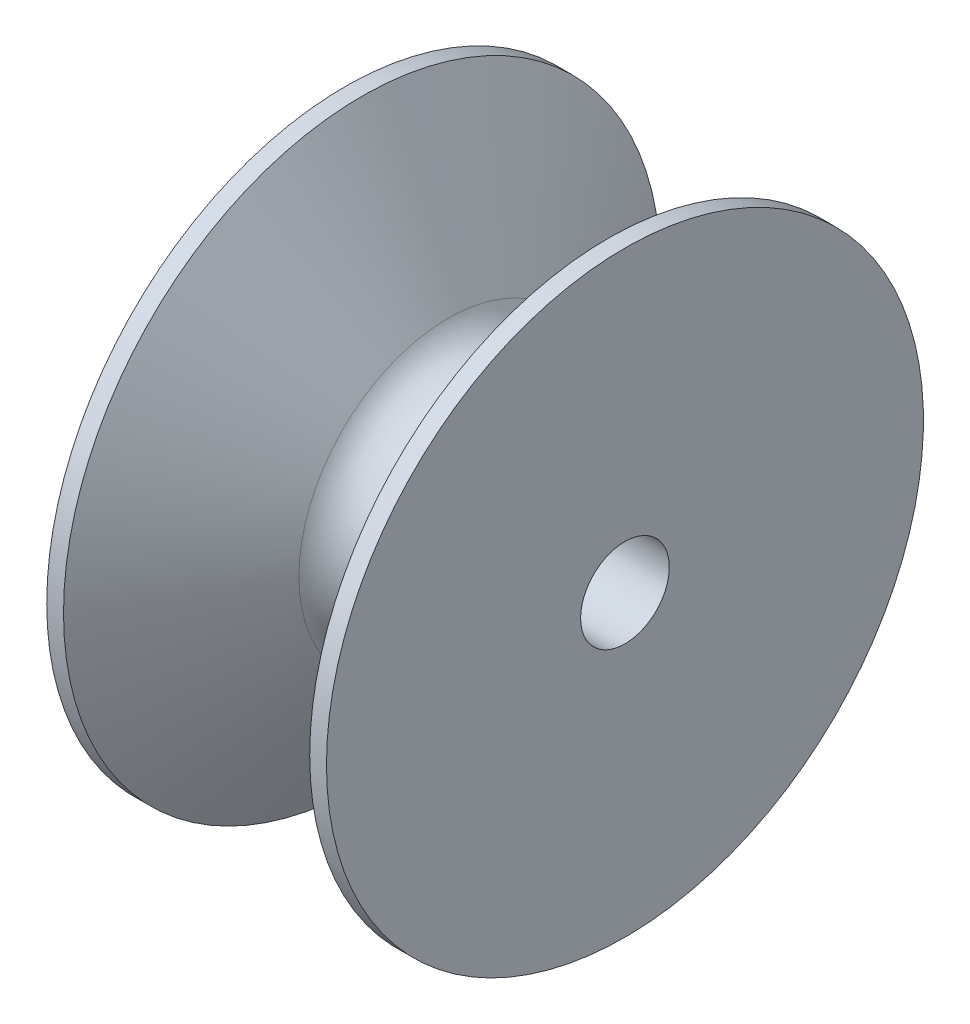
ISO-10303-21;
HEADER;
FILE_DESCRIPTION(('STEP AP214'),'2;1');
FILE_NAME('part.step','',(''),(''),'','','');
FILE_SCHEMA(('AUTOMOTIVE_DESIGN { 1 0 10303 214 1 1 1 1 }'));
ENDSEC;
DATA;
#1=APPLICATION_CONTEXT('core data for automotive mechanical design processes');
#2=APPLICATION_PROTOCOL_DEFINITION('international standard','automotive_design',2000,#1);
#3=PRODUCT_CONTEXT('',#1,'mechanical');
#4=PRODUCT('Part','Part','',(#3));
#5=PRODUCT_RELATED_PRODUCT_CATEGORY('part','',(#4));
#6=PRODUCT_DEFINITION_FORMATION('','',#4);
#7=PRODUCT_DEFINITION_CONTEXT('part definition',#1,'design');
#8=PRODUCT_DEFINITION('design','',#6,#7);
#9=PRODUCT_DEFINITION_SHAPE('','',#8);
#10=(LENGTH_UNIT() NAMED_UNIT(*) SI_UNIT(.MILLI.,.METRE.));
#11=(NAMED_UNIT(*) PLANE_ANGLE_UNIT() SI_UNIT($,.RADIAN.));
#12=(NAMED_UNIT(*) SI_UNIT($,.STERADIAN.) SOLID_ANGLE_UNIT());
#13=UNCERTAINTY_MEASURE_WITH_UNIT(LENGTH_MEASURE(1.E-05),#10,'distance_accuracy_value','');
#14=(GEOMETRIC_REPRESENTATION_CONTEXT(3) GLOBAL_UNCERTAINTY_ASSIGNED_CONTEXT((#13)) GLOBAL_UNIT_ASSIGNED_CONTEXT((#10,
#11,#12)) REPRESENTATION_CONTEXT('',''));
#15=CARTESIAN_POINT('',(0.,0.,0.));
#16=DIRECTION('',(0.,0.,1.));
#17=DIRECTION('',(1.,0.,0.));
#18=AXIS2_PLACEMENT_3D('',#15,#16,#17);
#19=CARTESIAN_POINT('',(0.,11.1125,0.));
#20=DIRECTION('',(1.,0.,0.));
#21=DIRECTION('',(0.,0.,-1.));
#22=AXIS2_PLACEMENT_3D('',#19,#20,#21);
#23=PLANE('',#22);
#24=CARTESIAN_POINT('',(0.,0.,0.));
#25=DIRECTION('',(-1.,0.,0.));
#26=DIRECTION('',(0.,0.,1.));
#27=AXIS2_PLACEMENT_3D('',#24,#25,#26);
#28=CIRCLE('',#27,1.651);
#29=CARTESIAN_POINT('',(0.,0.,1.651));
#30=VERTEX_POINT('',#29);
#31=EDGE_CURVE('E78',#30,#30,#28,.T.);
#32=ORIENTED_EDGE('',*,*,#31,.F.);
#33=EDGE_LOOP('',(#32));
#34=FACE_BOUND('',#33,.T.);
#35=CARTESIAN_POINT('',(0.,0.,0.));
#36=DIRECTION('',(-1.,0.,0.));
#37=DIRECTION('',(0.,0.,1.));
#38=AXIS2_PLACEMENT_3D('',#35,#36,#37);
#39=CIRCLE('',#38,11.1125);
#40=CARTESIAN_POINT('',(0.,0.,11.1125));
#41=VERTEX_POINT('',#40);
#42=EDGE_CURVE('E10',#41,#41,#39,.T.);
#43=ORIENTED_EDGE('',*,*,#42,.T.);
#44=EDGE_LOOP('',(#43));
#45=FACE_BOUND('',#44,.T.);
#46=ADVANCED_FACE('F43',(#34,#45),#23,.F.);
#47=CARTESIAN_POINT('',(0.,0.,0.));
#48=DIRECTION('',(-1.,0.,0.));
#49=DIRECTION('',(0.,0.,1.));
#50=AXIS2_PLACEMENT_3D('',#47,#48,#49);
#51=CYLINDRICAL_SURFACE('',#50,11.1125);
#52=ORIENTED_EDGE('',*,*,#42,.F.);
#53=EDGE_LOOP('',(#52));
#54=FACE_BOUND('',#53,.T.);
#55=CARTESIAN_POINT('',(0.624282238307362,0.,0.));
#56=DIRECTION('',(-1.,0.,0.));
#57=DIRECTION('',(0.,0.,1.));
#58=AXIS2_PLACEMENT_3D('',#55,#56,#57);
#59=CIRCLE('',#58,11.1125);
#60=CARTESIAN_POINT('',(0.624282238307362,0.,11.1125));
#61=VERTEX_POINT('',#60);
#62=EDGE_CURVE('E50',#61,#61,#59,.T.);
#63=ORIENTED_EDGE('',*,*,#62,.T.);
#64=EDGE_LOOP('',(#63));
#65=FACE_BOUND('',#64,.T.);
#66=ADVANCED_FACE('F86',(#54,#65),#51,.T.);
#67=CARTESIAN_POINT('',(3.8321846714922,0.,0.));
#68=DIRECTION('',(-1.,0.,0.));
#69=DIRECTION('',(0.,0.,1.));
#70=AXIS2_PLACEMENT_3D('',#67,#68,#69);
#71=CONICAL_SURFACE('',#70,5.55625,1.0471975511966);
#72=ORIENTED_EDGE('',*,*,#62,.F.);
#73=EDGE_LOOP('',(#72));
#74=FACE_BOUND('',#73,.T.);
#75=CARTESIAN_POINT('',(3.8321846714922,0.,0.));
#76=DIRECTION('',(-1.,0.,0.));
#77=DIRECTION('',(0.,0.,1.));
#78=AXIS2_PLACEMENT_3D('',#75,#76,#77);
#79=CIRCLE('',#78,5.55625);
#80=CARTESIAN_POINT('',(3.8321846714922,0.,5.55625));
#81=VERTEX_POINT('',#80);
#82=EDGE_CURVE('E55',#81,#81,#79,.T.);
#83=ORIENTED_EDGE('',*,*,#82,.T.);
#84=EDGE_LOOP('',(#83));
#85=FACE_BOUND('',#84,.T.);
#86=ADVANCED_FACE('F90',(#74,#85),#71,.T.);
#87=CARTESIAN_POINT('',(5.207,0.,0.));
#88=DIRECTION('',(-1.,0.,0.));
#89=DIRECTION('',(0.,0.,1.));
#90=AXIS2_PLACEMENT_3D('',#87,#88,#89);
#91=TOROIDAL_SURFACE('',#90,6.35,1.5875);
#92=ORIENTED_EDGE('',*,*,#82,.F.);
#93=EDGE_LOOP('',(#92));
#94=FACE_BOUND('',#93,.T.);
#95=CARTESIAN_POINT('',(6.5818153285078,0.,0.));
#96=DIRECTION('',(-1.,0.,0.));
#97=DIRECTION('',(0.,0.,1.));
#98=AXIS2_PLACEMENT_3D('',#95,#96,#97);
#99=CIRCLE('',#98,5.55625);
#100=CARTESIAN_POINT('',(6.5818153285078,0.,5.55625));
#101=VERTEX_POINT('',#100);
#102=EDGE_CURVE('E61',#101,#101,#99,.T.);
#103=ORIENTED_EDGE('',*,*,#102,.T.);
#104=EDGE_LOOP('',(#103));
#105=FACE_BOUND('',#104,.T.);
#106=ADVANCED_FACE('F95',(#94,#105),#91,.F.);
#107=CARTESIAN_POINT('',(9.78971776169264,0.,0.));
#108=DIRECTION('',(1.,0.,0.));
#109=DIRECTION('',(0.,0.,-1.));
#110=AXIS2_PLACEMENT_3D('',#107,#108,#109);
#111=CONICAL_SURFACE('',#110,11.1125,1.0471975511966);
#112=ORIENTED_EDGE('',*,*,#102,.F.);
#113=EDGE_LOOP('',(#112));
#114=FACE_BOUND('',#113,.T.);
#115=CARTESIAN_POINT('',(9.78971776169264,0.,0.));
#116=DIRECTION('',(-1.,0.,0.));
#117=DIRECTION('',(0.,0.,1.));
#118=AXIS2_PLACEMENT_3D('',#115,#116,#117);
#119=CIRCLE('',#118,11.1125);
#120=CARTESIAN_POINT('',(9.78971776169264,0.,11.1125));
#121=VERTEX_POINT('',#120);
#122=EDGE_CURVE('E67',#121,#121,#119,.T.);
#123=ORIENTED_EDGE('',*,*,#122,.T.);
#124=EDGE_LOOP('',(#123));
#125=FACE_BOUND('',#124,.T.);
#126=ADVANCED_FACE('F100',(#114,#125),#111,.T.);
#127=CARTESIAN_POINT('',(0.,0.,0.));
#128=DIRECTION('',(-1.,0.,0.));
#129=DIRECTION('',(0.,0.,1.));
#130=AXIS2_PLACEMENT_3D('',#127,#128,#129);
#131=CYLINDRICAL_SURFACE('',#130,11.1125);
#132=ORIENTED_EDGE('',*,*,#122,.F.);
#133=EDGE_LOOP('',(#132));
#134=FACE_BOUND('',#133,.T.);
#135=CARTESIAN_POINT('',(10.414,0.,0.));
#136=DIRECTION('',(-1.,0.,0.));
#137=DIRECTION('',(0.,0.,1.));
#138=AXIS2_PLACEMENT_3D('',#135,#136,#137);
#139=CIRCLE('',#138,11.1125);
#140=CARTESIAN_POINT('',(10.414,0.,11.1125));
#141=VERTEX_POINT('',#140);
#142=EDGE_CURVE('E71',#141,#141,#139,.T.);
#143=ORIENTED_EDGE('',*,*,#142,.T.);
#144=EDGE_LOOP('',(#143));
#145=FACE_BOUND('',#144,.T.);
#146=ADVANCED_FACE('F104',(#134,#145),#131,.T.);
#147=CARTESIAN_POINT('',(10.414,1.651,0.));
#148=DIRECTION('',(-1.,0.,0.));
#149=DIRECTION('',(0.,0.,1.));
#150=AXIS2_PLACEMENT_3D('',#147,#148,#149);
#151=PLANE('',#150);
#152=ORIENTED_EDGE('',*,*,#142,.F.);
#153=EDGE_LOOP('',(#152));
#154=FACE_BOUND('',#153,.T.);
#155=CARTESIAN_POINT('',(10.414,0.,0.));
#156=DIRECTION('',(-1.,0.,0.));
#157=DIRECTION('',(0.,0.,1.));
#158=AXIS2_PLACEMENT_3D('',#155,#156,#157);
#159=CIRCLE('',#158,1.651);
#160=CARTESIAN_POINT('',(10.414,0.,1.651));
#161=VERTEX_POINT('',#160);
#162=EDGE_CURVE('E75',#161,#161,#159,.T.);
#163=ORIENTED_EDGE('',*,*,#162,.T.);
#164=EDGE_LOOP('',(#163));
#165=FACE_BOUND('',#164,.T.);
#166=ADVANCED_FACE('F108',(#154,#165),#151,.F.);
#167=CARTESIAN_POINT('',(0.,0.,0.));
#168=DIRECTION('',(-1.,0.,0.));
#169=DIRECTION('',(0.,0.,1.));
#170=AXIS2_PLACEMENT_3D('',#167,#168,#169);
#171=CYLINDRICAL_SURFACE('',#170,1.651);
#172=ORIENTED_EDGE('',*,*,#162,.F.);
#173=EDGE_LOOP('',(#172));
#174=FACE_BOUND('',#173,.T.);
#175=ORIENTED_EDGE('',*,*,#31,.T.);
#176=EDGE_LOOP('',(#175));
#177=FACE_BOUND('',#176,.T.);
#178=ADVANCED_FACE('F83',(#174,#177),#171,.F.);
#179=CLOSED_SHELL('',(#46,#66,#86,#106,#126,#146,#166,#178));
#180=MANIFOLD_SOLID_BREP('B2',#179);
#181=ADVANCED_BREP_SHAPE_REPRESENTATION('',(#18,#180),#14);
#182=SHAPE_DEFINITION_REPRESENTATION(#9,#181);
ENDSEC;
END-ISO-10303-21;
